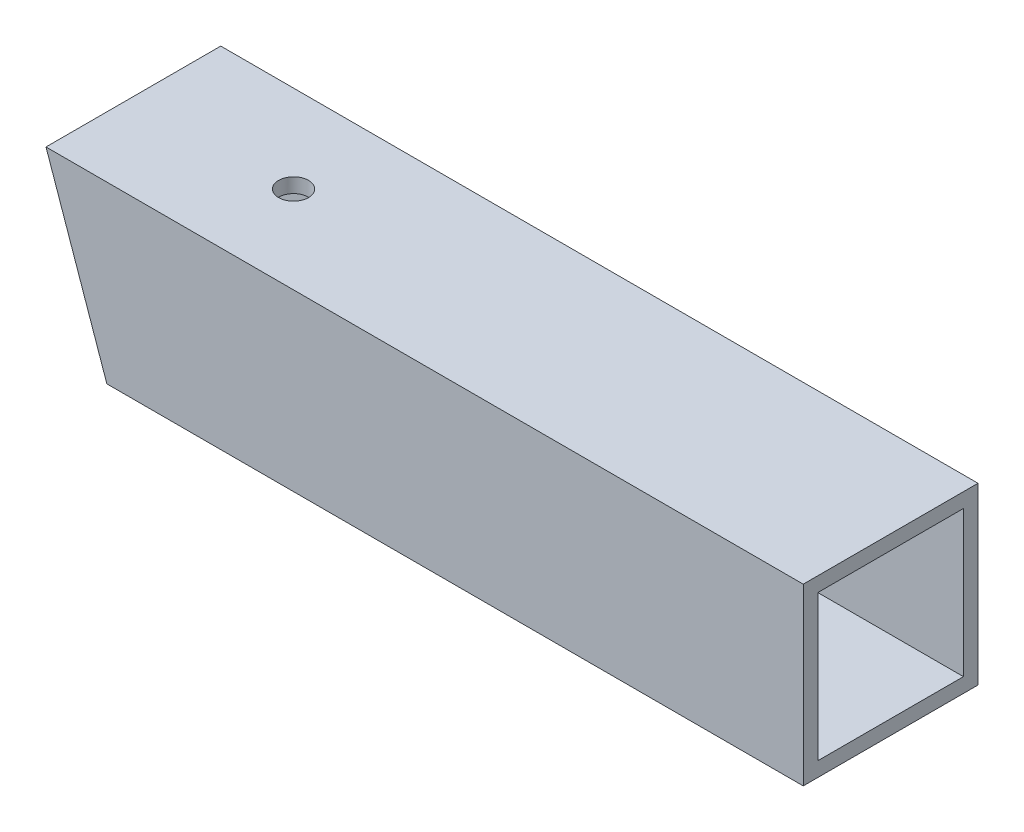
ISO-10303-21;
HEADER;
FILE_DESCRIPTION(('STEP AP214'),'2;1');
FILE_NAME('part.step','',(''),(''),'','','');
FILE_SCHEMA(('AUTOMOTIVE_DESIGN { 1 0 10303 214 1 1 1 1 }'));
ENDSEC;
DATA;
#1=APPLICATION_CONTEXT('core data for automotive mechanical design processes');
#2=APPLICATION_PROTOCOL_DEFINITION('international standard','automotive_design',2000,#1);
#3=PRODUCT_CONTEXT('',#1,'mechanical');
#4=PRODUCT('Part','Part','',(#3));
#5=PRODUCT_RELATED_PRODUCT_CATEGORY('part','',(#4));
#6=PRODUCT_DEFINITION_FORMATION('','',#4);
#7=PRODUCT_DEFINITION_CONTEXT('part definition',#1,'design');
#8=PRODUCT_DEFINITION('design','',#6,#7);
#9=PRODUCT_DEFINITION_SHAPE('','',#8);
#10=(LENGTH_UNIT() NAMED_UNIT(*) SI_UNIT(.MILLI.,.METRE.));
#11=(NAMED_UNIT(*) PLANE_ANGLE_UNIT() SI_UNIT($,.RADIAN.));
#12=(NAMED_UNIT(*) SI_UNIT($,.STERADIAN.) SOLID_ANGLE_UNIT());
#13=UNCERTAINTY_MEASURE_WITH_UNIT(LENGTH_MEASURE(1.E-05),#10,'distance_accuracy_value','');
#14=(GEOMETRIC_REPRESENTATION_CONTEXT(3) GLOBAL_UNCERTAINTY_ASSIGNED_CONTEXT((#13)) GLOBAL_UNIT_ASSIGNED_CONTEXT((#10,
#11,#12)) REPRESENTATION_CONTEXT('',''));
#15=CARTESIAN_POINT('',(0.,0.,0.));
#16=DIRECTION('',(0.,0.,1.));
#17=DIRECTION('',(1.,0.,0.));
#18=AXIS2_PLACEMENT_3D('',#15,#16,#17);
#19=CARTESIAN_POINT('',(0.,1009.65,-38.1));
#20=DIRECTION('',(0.,-1.,0.));
#21=DIRECTION('',(0.,0.,-1.));
#22=AXIS2_PLACEMENT_3D('',#19,#20,#21);
#23=PLANE('',#22);
#24=CARTESIAN_POINT('',(-168.275,1009.65,-19.05));
#25=DIRECTION('',(0.,1.,0.));
#26=DIRECTION('',(0.,0.,1.));
#27=AXIS2_PLACEMENT_3D('',#24,#25,#26);
#28=CIRCLE('',#27,3.26389999999999);
#29=CARTESIAN_POINT('',(-168.275,1009.65,-15.7861));
#30=VERTEX_POINT('',#29);
#31=EDGE_CURVE('E207',#30,#30,#28,.T.);
#32=ORIENTED_EDGE('',*,*,#31,.F.);
#33=EDGE_LOOP('',(#32));
#34=FACE_BOUND('',#33,.T.);
#35=DIRECTION('',(0.,0.,1.));
#36=VECTOR('',#35,1.);
#37=CARTESIAN_POINT('',(-38.1,1009.65,-38.1));
#38=LINE('',#37,#36);
#39=CARTESIAN_POINT('',(-38.1,1009.65,-38.1));
#40=VERTEX_POINT('',#39);
#41=CARTESIAN_POINT('',(-38.1,1009.65,0.));
#42=VERTEX_POINT('',#41);
#43=EDGE_CURVE('E99',#40,#42,#38,.T.);
#44=ORIENTED_EDGE('',*,*,#43,.F.);
#45=DIRECTION('',(-1.,0.,0.));
#46=VECTOR('',#45,1.);
#47=CARTESIAN_POINT('',(0.,1009.65,-38.1));
#48=LINE('',#47,#46);
#49=CARTESIAN_POINT('',(-203.2,1009.65,-38.1));
#50=VERTEX_POINT('',#49);
#51=EDGE_CURVE('E122',#40,#50,#48,.T.);
#52=ORIENTED_EDGE('',*,*,#51,.T.);
#53=DIRECTION('',(0.,0.,-1.));
#54=VECTOR('',#53,1.);
#55=CARTESIAN_POINT('',(-203.2,1009.65,-38.1));
#56=LINE('',#55,#54);
#57=CARTESIAN_POINT('',(-203.2,1009.65,0.));
#58=VERTEX_POINT('',#57);
#59=EDGE_CURVE('E141',#58,#50,#56,.T.);
#60=ORIENTED_EDGE('',*,*,#59,.F.);
#61=DIRECTION('',(-1.,0.,0.));
#62=VECTOR('',#61,1.);
#63=CARTESIAN_POINT('',(0.,1009.65,0.));
#64=LINE('',#63,#62);
#65=EDGE_CURVE('E118',#42,#58,#64,.T.);
#66=ORIENTED_EDGE('',*,*,#65,.F.);
#67=EDGE_LOOP('',(#44,#52,#60,#66));
#68=FACE_BOUND('',#67,.T.);
#69=ADVANCED_FACE('F33',(#34,#68),#23,.F.);
#70=CARTESIAN_POINT('',(0.,971.55,0.));
#71=DIRECTION('',(0.,0.,-1.));
#72=DIRECTION('',(-1.,0.,0.));
#73=AXIS2_PLACEMENT_3D('',#70,#71,#72);
#74=PLANE('',#73);
#75=DIRECTION('',(0.,1.,0.));
#76=VECTOR('',#75,1.);
#77=CARTESIAN_POINT('',(-38.1,0.,0.));
#78=LINE('',#77,#76);
#79=CARTESIAN_POINT('',(-38.1,971.55,0.));
#80=VERTEX_POINT('',#79);
#81=EDGE_CURVE('E95',#80,#42,#78,.T.);
#82=ORIENTED_EDGE('',*,*,#81,.T.);
#83=ORIENTED_EDGE('',*,*,#65,.T.);
#84=DIRECTION('',(-0.328893527070391,0.944367009086615,0.));
#85=VECTOR('',#84,1.);
#86=CARTESIAN_POINT('',(-169.385947437955,912.558166154691,0.));
#87=LINE('',#86,#85);
#88=CARTESIAN_POINT('',(-189.930960250823,971.55,0.));
#89=VERTEX_POINT('',#88);
#90=EDGE_CURVE('E116',#89,#58,#87,.T.);
#91=ORIENTED_EDGE('',*,*,#90,.F.);
#92=DIRECTION('',(-1.,0.,0.));
#93=VECTOR('',#92,1.);
#94=CARTESIAN_POINT('',(0.,971.55,0.));
#95=LINE('',#94,#93);
#96=EDGE_CURVE('E109',#80,#89,#95,.T.);
#97=ORIENTED_EDGE('',*,*,#96,.F.);
#98=EDGE_LOOP('',(#82,#83,#91,#97));
#99=FACE_BOUND('',#98,.T.);
#100=ADVANCED_FACE('F114',(#99),#74,.F.);
#101=CARTESIAN_POINT('',(0.,971.55,-38.1));
#102=DIRECTION('',(0.,1.,0.));
#103=DIRECTION('',(0.,0.,1.));
#104=AXIS2_PLACEMENT_3D('',#101,#102,#103);
#105=PLANE('',#104);
#106=CARTESIAN_POINT('',(-168.275,971.55,-19.05));
#107=DIRECTION('',(0.,1.,0.));
#108=DIRECTION('',(0.,0.,1.));
#109=AXIS2_PLACEMENT_3D('',#106,#107,#108);
#110=CIRCLE('',#109,3.26389999999999);
#111=CARTESIAN_POINT('',(-168.275,971.55,-15.7861));
#112=VERTEX_POINT('',#111);
#113=EDGE_CURVE('E209',#112,#112,#110,.F.);
#114=ORIENTED_EDGE('',*,*,#113,.F.);
#115=EDGE_LOOP('',(#114));
#116=FACE_BOUND('',#115,.T.);
#117=DIRECTION('',(0.,0.,-1.));
#118=VECTOR('',#117,1.);
#119=CARTESIAN_POINT('',(-38.1,971.55,-38.1));
#120=LINE('',#119,#118);
#121=CARTESIAN_POINT('',(-38.1,971.55,-38.1));
#122=VERTEX_POINT('',#121);
#123=EDGE_CURVE('E98',#80,#122,#120,.T.);
#124=ORIENTED_EDGE('',*,*,#123,.F.);
#125=ORIENTED_EDGE('',*,*,#96,.T.);
#126=DIRECTION('',(0.,0.,1.));
#127=VECTOR('',#126,1.);
#128=CARTESIAN_POINT('',(-189.930960250823,971.55,-38.1));
#129=LINE('',#128,#127);
#130=CARTESIAN_POINT('',(-189.930960250823,971.55,-38.1));
#131=VERTEX_POINT('',#130);
#132=EDGE_CURVE('E150',#131,#89,#129,.T.);
#133=ORIENTED_EDGE('',*,*,#132,.F.);
#134=DIRECTION('',(-1.,0.,0.));
#135=VECTOR('',#134,1.);
#136=CARTESIAN_POINT('',(0.,971.55,-38.1));
#137=LINE('',#136,#135);
#138=EDGE_CURVE('E111',#122,#131,#137,.T.);
#139=ORIENTED_EDGE('',*,*,#138,.F.);
#140=EDGE_LOOP('',(#124,#125,#133,#139));
#141=FACE_BOUND('',#140,.T.);
#142=ADVANCED_FACE('F107',(#116,#141),#105,.F.);
#143=CARTESIAN_POINT('',(0.,971.55,-38.1));
#144=DIRECTION('',(0.,0.,1.));
#145=DIRECTION('',(1.,0.,0.));
#146=AXIS2_PLACEMENT_3D('',#143,#144,#145);
#147=PLANE('',#146);
#148=DIRECTION('',(0.,1.,0.));
#149=VECTOR('',#148,1.);
#150=CARTESIAN_POINT('',(-38.1,0.,-38.1));
#151=LINE('',#150,#149);
#152=EDGE_CURVE('E48',#122,#40,#151,.T.);
#153=ORIENTED_EDGE('',*,*,#152,.F.);
#154=ORIENTED_EDGE('',*,*,#138,.T.);
#155=DIRECTION('',(0.328893527070391,-0.944367009086615,0.));
#156=VECTOR('',#155,1.);
#157=CARTESIAN_POINT('',(-169.385947437955,912.558166154691,-38.1));
#158=LINE('',#157,#156);
#159=EDGE_CURVE('E173',#50,#131,#158,.T.);
#160=ORIENTED_EDGE('',*,*,#159,.F.);
#161=ORIENTED_EDGE('',*,*,#51,.F.);
#162=EDGE_LOOP('',(#153,#154,#160,#161));
#163=FACE_BOUND('',#162,.T.);
#164=ADVANCED_FACE('F175',(#163),#147,.F.);
#165=CARTESIAN_POINT('',(-203.2,1009.65,0.));
#166=DIRECTION('',(-0.944367009086615,-0.328893527070391,0.));
#167=DIRECTION('',(0.328893527070391,-0.944367009086615,0.));
#168=AXIS2_PLACEMENT_3D('',#165,#166,#167);
#169=PLANE('',#168);
#170=DIRECTION('',(0.,0.,-1.));
#171=VECTOR('',#170,1.);
#172=CARTESIAN_POINT('',(-202.094246687569,1006.475,-34.925));
#173=LINE('',#172,#171);
#174=CARTESIAN_POINT('',(-202.094246687569,1006.475,-3.175));
#175=VERTEX_POINT('',#174);
#176=CARTESIAN_POINT('',(-202.094246687569,1006.475,-34.925));
#177=VERTEX_POINT('',#176);
#178=EDGE_CURVE('E164',#175,#177,#173,.T.);
#179=ORIENTED_EDGE('',*,*,#178,.F.);
#180=DIRECTION('',(-0.328893527070391,0.944367009086615,0.));
#181=VECTOR('',#180,1.);
#182=CARTESIAN_POINT('',(-170.372090361739,915.389723381619,-3.175));
#183=LINE('',#182,#181);
#184=CARTESIAN_POINT('',(-191.036713563254,974.725,-3.175));
#185=VERTEX_POINT('',#184);
#186=EDGE_CURVE('E41',#185,#175,#183,.T.);
#187=ORIENTED_EDGE('',*,*,#186,.F.);
#188=DIRECTION('',(0.,0.,1.));
#189=VECTOR('',#188,1.);
#190=CARTESIAN_POINT('',(-191.036713563254,974.725,-34.925));
#191=LINE('',#190,#189);
#192=CARTESIAN_POINT('',(-191.036713563254,974.725,-34.925));
#193=VERTEX_POINT('',#192);
#194=EDGE_CURVE('E112',#193,#185,#191,.T.);
#195=ORIENTED_EDGE('',*,*,#194,.F.);
#196=DIRECTION('',(0.328893527070391,-0.944367009086615,0.));
#197=VECTOR('',#196,1.);
#198=CARTESIAN_POINT('',(-170.372090361739,915.389723381619,-34.925));
#199=LINE('',#198,#197);
#200=EDGE_CURVE('E167',#177,#193,#199,.T.);
#201=ORIENTED_EDGE('',*,*,#200,.F.);
#202=EDGE_LOOP('',(#179,#187,#195,#201));
#203=FACE_BOUND('',#202,.T.);
#204=ORIENTED_EDGE('',*,*,#90,.T.);
#205=ORIENTED_EDGE('',*,*,#59,.T.);
#206=ORIENTED_EDGE('',*,*,#159,.T.);
#207=ORIENTED_EDGE('',*,*,#132,.T.);
#208=EDGE_LOOP('',(#204,#205,#206,#207));
#209=FACE_BOUND('',#208,.T.);
#210=ADVANCED_FACE('F162',(#203,#209),#169,.T.);
#211=CARTESIAN_POINT('',(0.,1006.475,-34.925));
#212=DIRECTION('',(0.,-1.,0.));
#213=DIRECTION('',(0.,0.,-1.));
#214=AXIS2_PLACEMENT_3D('',#211,#212,#213);
#215=PLANE('',#214);
#216=CARTESIAN_POINT('',(-168.275,1006.475,-19.05));
#217=DIRECTION('',(0.,-1.,0.));
#218=DIRECTION('',(0.,0.,-1.));
#219=AXIS2_PLACEMENT_3D('',#216,#217,#218);
#220=CIRCLE('',#219,3.26389999999999);
#221=CARTESIAN_POINT('',(-168.275,1006.475,-22.3139));
#222=VERTEX_POINT('',#221);
#223=EDGE_CURVE('E176',#222,#222,#220,.T.);
#224=ORIENTED_EDGE('',*,*,#223,.F.);
#225=EDGE_LOOP('',(#224));
#226=FACE_BOUND('',#225,.T.);
#227=DIRECTION('',(-1.,0.,0.));
#228=VECTOR('',#227,1.);
#229=CARTESIAN_POINT('',(0.,1006.475,-34.925));
#230=LINE('',#229,#228);
#231=CARTESIAN_POINT('',(-38.1,1006.475,-34.925));
#232=VERTEX_POINT('',#231);
#233=EDGE_CURVE('E127',#232,#177,#230,.T.);
#234=ORIENTED_EDGE('',*,*,#233,.F.);
#235=DIRECTION('',(0.,0.,1.));
#236=VECTOR('',#235,1.);
#237=CARTESIAN_POINT('',(-38.1,1006.475,-34.925));
#238=LINE('',#237,#236);
#239=CARTESIAN_POINT('',(-38.1,1006.475,-3.175));
#240=VERTEX_POINT('',#239);
#241=EDGE_CURVE('E11',#232,#240,#238,.T.);
#242=ORIENTED_EDGE('',*,*,#241,.T.);
#243=DIRECTION('',(-1.,0.,0.));
#244=VECTOR('',#243,1.);
#245=CARTESIAN_POINT('',(0.,1006.475,-3.175));
#246=LINE('',#245,#244);
#247=EDGE_CURVE('E120',#240,#175,#246,.T.);
#248=ORIENTED_EDGE('',*,*,#247,.T.);
#249=ORIENTED_EDGE('',*,*,#178,.T.);
#250=EDGE_LOOP('',(#234,#242,#248,#249));
#251=FACE_BOUND('',#250,.T.);
#252=ADVANCED_FACE('F187',(#226,#251),#215,.T.);
#253=CARTESIAN_POINT('',(0.,974.725,-34.925));
#254=DIRECTION('',(0.,0.,1.));
#255=DIRECTION('',(1.,0.,0.));
#256=AXIS2_PLACEMENT_3D('',#253,#254,#255);
#257=PLANE('',#256);
#258=DIRECTION('',(-1.,0.,0.));
#259=VECTOR('',#258,1.);
#260=CARTESIAN_POINT('',(0.,974.725,-34.925));
#261=LINE('',#260,#259);
#262=CARTESIAN_POINT('',(-38.1,974.725,-34.925));
#263=VERTEX_POINT('',#262);
#264=EDGE_CURVE('E131',#263,#193,#261,.T.);
#265=ORIENTED_EDGE('',*,*,#264,.F.);
#266=DIRECTION('',(0.,1.,0.));
#267=VECTOR('',#266,1.);
#268=CARTESIAN_POINT('',(-38.1,974.725,-34.925));
#269=LINE('',#268,#267);
#270=EDGE_CURVE('E103',#263,#232,#269,.T.);
#271=ORIENTED_EDGE('',*,*,#270,.T.);
#272=ORIENTED_EDGE('',*,*,#233,.T.);
#273=ORIENTED_EDGE('',*,*,#200,.T.);
#274=EDGE_LOOP('',(#265,#271,#272,#273));
#275=FACE_BOUND('',#274,.T.);
#276=ADVANCED_FACE('F185',(#275),#257,.T.);
#277=CARTESIAN_POINT('',(0.,974.725,-34.925));
#278=DIRECTION('',(0.,1.,0.));
#279=DIRECTION('',(0.,0.,1.));
#280=AXIS2_PLACEMENT_3D('',#277,#278,#279);
#281=PLANE('',#280);
#282=CARTESIAN_POINT('',(-168.275,974.725,-19.05));
#283=DIRECTION('',(0.,1.,0.));
#284=DIRECTION('',(0.,0.,1.));
#285=AXIS2_PLACEMENT_3D('',#282,#283,#284);
#286=CIRCLE('',#285,3.26389999999999);
#287=CARTESIAN_POINT('',(-168.275,974.725,-15.7861));
#288=VERTEX_POINT('',#287);
#289=EDGE_CURVE('E36',#288,#288,#286,.T.);
#290=ORIENTED_EDGE('',*,*,#289,.F.);
#291=EDGE_LOOP('',(#290));
#292=FACE_BOUND('',#291,.T.);
#293=DIRECTION('',(-1.,0.,0.));
#294=VECTOR('',#293,1.);
#295=CARTESIAN_POINT('',(0.,974.725,-3.175));
#296=LINE('',#295,#294);
#297=CARTESIAN_POINT('',(-38.1,974.725,-3.175));
#298=VERTEX_POINT('',#297);
#299=EDGE_CURVE('E138',#298,#185,#296,.T.);
#300=ORIENTED_EDGE('',*,*,#299,.F.);
#301=DIRECTION('',(0.,0.,-1.));
#302=VECTOR('',#301,1.);
#303=CARTESIAN_POINT('',(-38.1,974.725,-34.925));
#304=LINE('',#303,#302);
#305=EDGE_CURVE('E183',#298,#263,#304,.T.);
#306=ORIENTED_EDGE('',*,*,#305,.T.);
#307=ORIENTED_EDGE('',*,*,#264,.T.);
#308=ORIENTED_EDGE('',*,*,#194,.T.);
#309=EDGE_LOOP('',(#300,#306,#307,#308));
#310=FACE_BOUND('',#309,.T.);
#311=ADVANCED_FACE('F165',(#292,#310),#281,.T.);
#312=CARTESIAN_POINT('',(0.,974.725,-3.175));
#313=DIRECTION('',(0.,0.,-1.));
#314=DIRECTION('',(-1.,0.,0.));
#315=AXIS2_PLACEMENT_3D('',#312,#313,#314);
#316=PLANE('',#315);
#317=ORIENTED_EDGE('',*,*,#247,.F.);
#318=DIRECTION('',(0.,-1.,0.));
#319=VECTOR('',#318,1.);
#320=CARTESIAN_POINT('',(-38.1,974.725,-3.175));
#321=LINE('',#320,#319);
#322=EDGE_CURVE('E56',#240,#298,#321,.T.);
#323=ORIENTED_EDGE('',*,*,#322,.T.);
#324=ORIENTED_EDGE('',*,*,#299,.T.);
#325=ORIENTED_EDGE('',*,*,#186,.T.);
#326=EDGE_LOOP('',(#317,#323,#324,#325));
#327=FACE_BOUND('',#326,.T.);
#328=ADVANCED_FACE('F155',(#327),#316,.T.);
#329=CARTESIAN_POINT('',(-38.1,0.,-38.1));
#330=DIRECTION('',(1.,0.,0.));
#331=DIRECTION('',(0.,1.,0.));
#332=AXIS2_PLACEMENT_3D('',#329,#330,#331);
#333=PLANE('',#332);
#334=ORIENTED_EDGE('',*,*,#241,.F.);
#335=ORIENTED_EDGE('',*,*,#270,.F.);
#336=ORIENTED_EDGE('',*,*,#305,.F.);
#337=ORIENTED_EDGE('',*,*,#322,.F.);
#338=EDGE_LOOP('',(#334,#335,#336,#337));
#339=FACE_BOUND('',#338,.T.);
#340=ORIENTED_EDGE('',*,*,#123,.T.);
#341=ORIENTED_EDGE('',*,*,#152,.T.);
#342=ORIENTED_EDGE('',*,*,#43,.T.);
#343=ORIENTED_EDGE('',*,*,#81,.F.);
#344=EDGE_LOOP('',(#340,#341,#342,#343));
#345=FACE_BOUND('',#344,.T.);
#346=ADVANCED_FACE('F97',(#339,#345),#333,.T.);
#347=CARTESIAN_POINT('',(-168.275,1009.65,-19.05));
#348=DIRECTION('',(0.,1.,0.));
#349=DIRECTION('',(0.,0.,1.));
#350=AXIS2_PLACEMENT_3D('',#347,#348,#349);
#351=CYLINDRICAL_SURFACE('',#350,3.26389999999999);
#352=ORIENTED_EDGE('',*,*,#289,.T.);
#353=EDGE_LOOP('',(#352));
#354=FACE_BOUND('',#353,.T.);
#355=ORIENTED_EDGE('',*,*,#113,.T.);
#356=EDGE_LOOP('',(#355));
#357=FACE_BOUND('',#356,.T.);
#358=ADVANCED_FACE('F189',(#354,#357),#351,.F.);
#359=ORIENTED_EDGE('',*,*,#223,.T.);
#360=EDGE_LOOP('',(#359));
#361=FACE_BOUND('',#360,.T.);
#362=ORIENTED_EDGE('',*,*,#31,.T.);
#363=EDGE_LOOP('',(#362));
#364=FACE_BOUND('',#363,.T.);
#365=ADVANCED_FACE('F195',(#361,#364),#351,.F.);
#366=CLOSED_SHELL('',(#69,#100,#142,#164,#210,#252,#276,#311,#328,#346,#358,#365));
#367=MANIFOLD_SOLID_BREP('B2',#366);
#368=ADVANCED_BREP_SHAPE_REPRESENTATION('',(#18,#367),#14);
#369=SHAPE_DEFINITION_REPRESENTATION(#9,#368);
ENDSEC;
END-ISO-10303-21;
